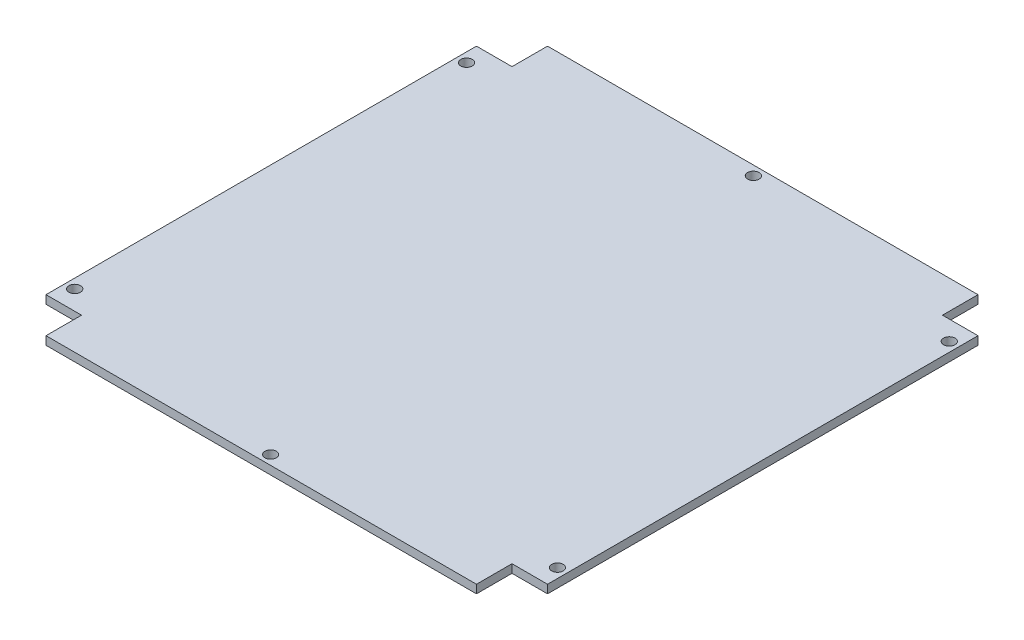
ISO-10303-21;
HEADER;
FILE_DESCRIPTION(('STEP AP214'),'2;1');
FILE_NAME('part.step','',(''),(''),'','','');
FILE_SCHEMA(('AUTOMOTIVE_DESIGN { 1 0 10303 214 1 1 1 1 }'));
ENDSEC;
DATA;
#1=APPLICATION_CONTEXT('core data for automotive mechanical design processes');
#2=APPLICATION_PROTOCOL_DEFINITION('international standard','automotive_design',2000,#1);
#3=PRODUCT_CONTEXT('',#1,'mechanical');
#4=PRODUCT('Part','Part','',(#3));
#5=PRODUCT_RELATED_PRODUCT_CATEGORY('part','',(#4));
#6=PRODUCT_DEFINITION_FORMATION('','',#4);
#7=PRODUCT_DEFINITION_CONTEXT('part definition',#1,'design');
#8=PRODUCT_DEFINITION('design','',#6,#7);
#9=PRODUCT_DEFINITION_SHAPE('','',#8);
#10=(LENGTH_UNIT() NAMED_UNIT(*) SI_UNIT(.MILLI.,.METRE.));
#11=(NAMED_UNIT(*) PLANE_ANGLE_UNIT() SI_UNIT($,.RADIAN.));
#12=(NAMED_UNIT(*) SI_UNIT($,.STERADIAN.) SOLID_ANGLE_UNIT());
#13=UNCERTAINTY_MEASURE_WITH_UNIT(LENGTH_MEASURE(1.E-05),#10,'distance_accuracy_value','');
#14=(GEOMETRIC_REPRESENTATION_CONTEXT(3) GLOBAL_UNCERTAINTY_ASSIGNED_CONTEXT((#13)) GLOBAL_UNIT_ASSIGNED_CONTEXT((#10,
#11,#12)) REPRESENTATION_CONTEXT('',''));
#15=CARTESIAN_POINT('',(0.,0.,0.));
#16=DIRECTION('',(0.,0.,1.));
#17=DIRECTION('',(1.,0.,0.));
#18=AXIS2_PLACEMENT_3D('',#15,#16,#17);
#19=CARTESIAN_POINT('',(-27.1443844543068,1.6,54.7714964370546));
#20=DIRECTION('',(0.,0.,1.));
#21=DIRECTION('',(1.,0.,0.));
#22=AXIS2_PLACEMENT_3D('',#19,#20,#21);
#23=PLANE('',#22);
#24=DIRECTION('',(0.,1.,0.));
#25=VECTOR('',#24,1.);
#26=CARTESIAN_POINT('',(-33.9443844543068,0.,54.7714964370546));
#27=LINE('',#26,#25);
#28=CARTESIAN_POINT('',(-33.9443844543068,0.,54.7714964370546));
#29=VERTEX_POINT('',#28);
#30=CARTESIAN_POINT('',(-33.9443844543068,1.6,54.7714964370546));
#31=VERTEX_POINT('',#30);
#32=EDGE_CURVE('E128',#29,#31,#27,.T.);
#33=ORIENTED_EDGE('',*,*,#32,.F.);
#34=DIRECTION('',(-1.,0.,0.));
#35=VECTOR('',#34,1.);
#36=CARTESIAN_POINT('',(-27.1443844543068,0.,54.7714964370546));
#37=LINE('',#36,#35);
#38=CARTESIAN_POINT('',(-27.1443844543068,0.,54.7714964370546));
#39=VERTEX_POINT('',#38);
#40=EDGE_CURVE('E139',#39,#29,#37,.T.);
#41=ORIENTED_EDGE('',*,*,#40,.F.);
#42=DIRECTION('',(0.,-1.,0.));
#43=VECTOR('',#42,1.);
#44=CARTESIAN_POINT('',(-27.1443844543068,1.6,54.7714964370546));
#45=LINE('',#44,#43);
#46=CARTESIAN_POINT('',(-27.1443844543068,1.6,54.7714964370546));
#47=VERTEX_POINT('',#46);
#48=EDGE_CURVE('E11',#47,#39,#45,.T.);
#49=ORIENTED_EDGE('',*,*,#48,.F.);
#50=DIRECTION('',(-1.,0.,0.));
#51=VECTOR('',#50,1.);
#52=CARTESIAN_POINT('',(-27.1443844543068,1.6,54.7714964370546));
#53=LINE('',#52,#51);
#54=EDGE_CURVE('E141',#47,#31,#53,.T.);
#55=ORIENTED_EDGE('',*,*,#54,.T.);
#56=EDGE_LOOP('',(#33,#41,#49,#55));
#57=FACE_BOUND('',#56,.T.);
#58=ADVANCED_FACE('F38',(#57),#23,.T.);
#59=CARTESIAN_POINT('',(-27.1443844543068,1.6,61.7714964370546));
#60=DIRECTION('',(-1.,0.,0.));
#61=DIRECTION('',(0.,0.,1.));
#62=AXIS2_PLACEMENT_3D('',#59,#60,#61);
#63=PLANE('',#62);
#64=DIRECTION('',(0.,1.,0.));
#65=VECTOR('',#64,1.);
#66=CARTESIAN_POINT('',(-27.1443844543068,0.,61.5714964370546));
#67=LINE('',#66,#65);
#68=CARTESIAN_POINT('',(-27.1443844543068,0.,61.5714964370546));
#69=VERTEX_POINT('',#68);
#70=CARTESIAN_POINT('',(-27.1443844543068,1.6,61.5714964370546));
#71=VERTEX_POINT('',#70);
#72=EDGE_CURVE('E62',#69,#71,#67,.T.);
#73=ORIENTED_EDGE('',*,*,#72,.T.);
#74=DIRECTION('',(0.,0.,-1.));
#75=VECTOR('',#74,1.);
#76=CARTESIAN_POINT('',(-27.1443844543068,1.6,61.7714964370546));
#77=LINE('',#76,#75);
#78=EDGE_CURVE('E156',#71,#47,#77,.T.);
#79=ORIENTED_EDGE('',*,*,#78,.T.);
#80=ORIENTED_EDGE('',*,*,#48,.T.);
#81=DIRECTION('',(0.,0.,-1.));
#82=VECTOR('',#81,1.);
#83=CARTESIAN_POINT('',(-27.1443844543068,0.,61.7714964370546));
#84=LINE('',#83,#82);
#85=EDGE_CURVE('E146',#69,#39,#84,.T.);
#86=ORIENTED_EDGE('',*,*,#85,.F.);
#87=EDGE_LOOP('',(#73,#79,#80,#86));
#88=FACE_BOUND('',#87,.T.);
#89=ADVANCED_FACE('F221',(#88),#63,.T.);
#90=CARTESIAN_POINT('',(55.2556155456932,1.6,54.7714964370546));
#91=DIRECTION('',(1.,0.,0.));
#92=DIRECTION('',(0.,0.,-1.));
#93=AXIS2_PLACEMENT_3D('',#90,#91,#92);
#94=PLANE('',#93);
#95=DIRECTION('',(0.,1.,0.));
#96=VECTOR('',#95,1.);
#97=CARTESIAN_POINT('',(55.2556155456932,0.,61.5714964370546));
#98=LINE('',#97,#96);
#99=CARTESIAN_POINT('',(55.2556155456932,0.,61.5714964370546));
#100=VERTEX_POINT('',#99);
#101=CARTESIAN_POINT('',(55.2556155456932,1.6,61.5714964370546));
#102=VERTEX_POINT('',#101);
#103=EDGE_CURVE('E233',#100,#102,#98,.T.);
#104=ORIENTED_EDGE('',*,*,#103,.F.);
#105=DIRECTION('',(0.,0.,1.));
#106=VECTOR('',#105,1.);
#107=CARTESIAN_POINT('',(55.2556155456932,0.,54.7714964370546));
#108=LINE('',#107,#106);
#109=CARTESIAN_POINT('',(55.2556155456932,0.,54.7714964370546));
#110=VERTEX_POINT('',#109);
#111=EDGE_CURVE('E168',#110,#100,#108,.T.);
#112=ORIENTED_EDGE('',*,*,#111,.F.);
#113=DIRECTION('',(0.,-1.,0.));
#114=VECTOR('',#113,1.);
#115=CARTESIAN_POINT('',(55.2556155456932,1.6,54.7714964370546));
#116=LINE('',#115,#114);
#117=CARTESIAN_POINT('',(55.2556155456932,1.6,54.7714964370546));
#118=VERTEX_POINT('',#117);
#119=EDGE_CURVE('E46',#118,#110,#116,.T.);
#120=ORIENTED_EDGE('',*,*,#119,.F.);
#121=DIRECTION('',(0.,0.,1.));
#122=VECTOR('',#121,1.);
#123=CARTESIAN_POINT('',(55.2556155456932,1.6,54.7714964370546));
#124=LINE('',#123,#122);
#125=EDGE_CURVE('E213',#118,#102,#124,.T.);
#126=ORIENTED_EDGE('',*,*,#125,.T.);
#127=EDGE_LOOP('',(#104,#112,#120,#126));
#128=FACE_BOUND('',#127,.T.);
#129=ADVANCED_FACE('F301',(#128),#94,.T.);
#130=CARTESIAN_POINT('',(62.2556155456932,1.6,54.7714964370546));
#131=DIRECTION('',(0.,0.,1.));
#132=DIRECTION('',(1.,0.,0.));
#133=AXIS2_PLACEMENT_3D('',#130,#131,#132);
#134=PLANE('',#133);
#135=DIRECTION('',(0.,1.,0.));
#136=VECTOR('',#135,1.);
#137=CARTESIAN_POINT('',(62.0556155456932,0.,54.7714964370546));
#138=LINE('',#137,#136);
#139=CARTESIAN_POINT('',(62.0556155456932,0.,54.7714964370546));
#140=VERTEX_POINT('',#139);
#141=CARTESIAN_POINT('',(62.0556155456932,1.6,54.7714964370546));
#142=VERTEX_POINT('',#141);
#143=EDGE_CURVE('E243',#140,#142,#138,.T.);
#144=ORIENTED_EDGE('',*,*,#143,.T.);
#145=DIRECTION('',(-1.,0.,0.));
#146=VECTOR('',#145,1.);
#147=CARTESIAN_POINT('',(62.2556155456932,1.6,54.7714964370546));
#148=LINE('',#147,#146);
#149=EDGE_CURVE('E212',#142,#118,#148,.T.);
#150=ORIENTED_EDGE('',*,*,#149,.T.);
#151=ORIENTED_EDGE('',*,*,#119,.T.);
#152=DIRECTION('',(-1.,0.,0.));
#153=VECTOR('',#152,1.);
#154=CARTESIAN_POINT('',(62.2556155456932,0.,54.7714964370546));
#155=LINE('',#154,#153);
#156=EDGE_CURVE('E166',#140,#110,#155,.T.);
#157=ORIENTED_EDGE('',*,*,#156,.F.);
#158=EDGE_LOOP('',(#144,#150,#151,#157));
#159=FACE_BOUND('',#158,.T.);
#160=ADVANCED_FACE('F306',(#159),#134,.T.);
#161=CARTESIAN_POINT('',(55.2556155456932,1.6,-27.6285035629454));
#162=DIRECTION('',(0.,0.,-1.));
#163=DIRECTION('',(-1.,0.,0.));
#164=AXIS2_PLACEMENT_3D('',#161,#162,#163);
#165=PLANE('',#164);
#166=DIRECTION('',(0.,1.,0.));
#167=VECTOR('',#166,1.);
#168=CARTESIAN_POINT('',(62.0556155456932,0.,-27.6285035629454));
#169=LINE('',#168,#167);
#170=CARTESIAN_POINT('',(62.0556155456932,0.,-27.6285035629454));
#171=VERTEX_POINT('',#170);
#172=CARTESIAN_POINT('',(62.0556155456932,1.6,-27.6285035629454));
#173=VERTEX_POINT('',#172);
#174=EDGE_CURVE('E241',#171,#173,#169,.T.);
#175=ORIENTED_EDGE('',*,*,#174,.F.);
#176=DIRECTION('',(1.,0.,0.));
#177=VECTOR('',#176,1.);
#178=CARTESIAN_POINT('',(55.2556155456932,0.,-27.6285035629454));
#179=LINE('',#178,#177);
#180=CARTESIAN_POINT('',(55.2556155456932,0.,-27.6285035629454));
#181=VERTEX_POINT('',#180);
#182=EDGE_CURVE('E163',#181,#171,#179,.T.);
#183=ORIENTED_EDGE('',*,*,#182,.F.);
#184=DIRECTION('',(0.,-1.,0.));
#185=VECTOR('',#184,1.);
#186=CARTESIAN_POINT('',(55.2556155456932,1.6,-27.6285035629454));
#187=LINE('',#186,#185);
#188=CARTESIAN_POINT('',(55.2556155456932,1.6,-27.6285035629454));
#189=VERTEX_POINT('',#188);
#190=EDGE_CURVE('E174',#189,#181,#187,.T.);
#191=ORIENTED_EDGE('',*,*,#190,.F.);
#192=DIRECTION('',(1.,0.,0.));
#193=VECTOR('',#192,1.);
#194=CARTESIAN_POINT('',(55.2556155456932,1.6,-27.6285035629454));
#195=LINE('',#194,#193);
#196=EDGE_CURVE('E209',#189,#173,#195,.T.);
#197=ORIENTED_EDGE('',*,*,#196,.T.);
#198=EDGE_LOOP('',(#175,#183,#191,#197));
#199=FACE_BOUND('',#198,.T.);
#200=ADVANCED_FACE('F311',(#199),#165,.T.);
#201=CARTESIAN_POINT('',(55.2556155456932,1.6,-34.6285035629454));
#202=DIRECTION('',(1.,0.,0.));
#203=DIRECTION('',(0.,0.,-1.));
#204=AXIS2_PLACEMENT_3D('',#201,#202,#203);
#205=PLANE('',#204);
#206=DIRECTION('',(0.,1.,0.));
#207=VECTOR('',#206,1.);
#208=CARTESIAN_POINT('',(55.2556155456932,0.,-34.4285035629454));
#209=LINE('',#208,#207);
#210=CARTESIAN_POINT('',(55.2556155456932,0.,-34.4285035629454));
#211=VERTEX_POINT('',#210);
#212=CARTESIAN_POINT('',(55.2556155456932,1.6,-34.4285035629454));
#213=VERTEX_POINT('',#212);
#214=EDGE_CURVE('E253',#211,#213,#209,.T.);
#215=ORIENTED_EDGE('',*,*,#214,.T.);
#216=DIRECTION('',(0.,0.,1.));
#217=VECTOR('',#216,1.);
#218=CARTESIAN_POINT('',(55.2556155456932,1.6,-34.6285035629454));
#219=LINE('',#218,#217);
#220=EDGE_CURVE('E207',#213,#189,#219,.T.);
#221=ORIENTED_EDGE('',*,*,#220,.T.);
#222=ORIENTED_EDGE('',*,*,#190,.T.);
#223=DIRECTION('',(0.,0.,1.));
#224=VECTOR('',#223,1.);
#225=CARTESIAN_POINT('',(55.2556155456932,0.,-34.6285035629454));
#226=LINE('',#225,#224);
#227=EDGE_CURVE('E161',#211,#181,#226,.T.);
#228=ORIENTED_EDGE('',*,*,#227,.F.);
#229=EDGE_LOOP('',(#215,#221,#222,#228));
#230=FACE_BOUND('',#229,.T.);
#231=ADVANCED_FACE('F315',(#230),#205,.T.);
#232=CARTESIAN_POINT('',(-27.1443844543068,1.6,-27.6285035629454));
#233=DIRECTION('',(-1.,0.,0.));
#234=DIRECTION('',(0.,0.,1.));
#235=AXIS2_PLACEMENT_3D('',#232,#233,#234);
#236=PLANE('',#235);
#237=DIRECTION('',(0.,1.,0.));
#238=VECTOR('',#237,1.);
#239=CARTESIAN_POINT('',(-27.1443844543068,0.,-34.4285035629454));
#240=LINE('',#239,#238);
#241=CARTESIAN_POINT('',(-27.1443844543068,0.,-34.4285035629454));
#242=VERTEX_POINT('',#241);
#243=CARTESIAN_POINT('',(-27.1443844543068,1.6,-34.4285035629454));
#244=VERTEX_POINT('',#243);
#245=EDGE_CURVE('E251',#242,#244,#240,.T.);
#246=ORIENTED_EDGE('',*,*,#245,.F.);
#247=DIRECTION('',(0.,0.,-1.));
#248=VECTOR('',#247,1.);
#249=CARTESIAN_POINT('',(-27.1443844543068,0.,-27.6285035629454));
#250=LINE('',#249,#248);
#251=CARTESIAN_POINT('',(-27.1443844543068,0.,-27.6285035629454));
#252=VERTEX_POINT('',#251);
#253=EDGE_CURVE('E150',#252,#242,#250,.T.);
#254=ORIENTED_EDGE('',*,*,#253,.F.);
#255=DIRECTION('',(0.,-1.,0.));
#256=VECTOR('',#255,1.);
#257=CARTESIAN_POINT('',(-27.1443844543068,1.6,-27.6285035629454));
#258=LINE('',#257,#256);
#259=CARTESIAN_POINT('',(-27.1443844543068,1.6,-27.6285035629454));
#260=VERTEX_POINT('',#259);
#261=EDGE_CURVE('E177',#260,#252,#258,.T.);
#262=ORIENTED_EDGE('',*,*,#261,.F.);
#263=DIRECTION('',(0.,0.,-1.));
#264=VECTOR('',#263,1.);
#265=CARTESIAN_POINT('',(-27.1443844543068,1.6,-27.6285035629454));
#266=LINE('',#265,#264);
#267=EDGE_CURVE('E204',#260,#244,#266,.T.);
#268=ORIENTED_EDGE('',*,*,#267,.T.);
#269=EDGE_LOOP('',(#246,#254,#262,#268));
#270=FACE_BOUND('',#269,.T.);
#271=ADVANCED_FACE('F319',(#270),#236,.T.);
#272=CARTESIAN_POINT('',(-34.1443844543068,1.6,-27.6285035629454));
#273=DIRECTION('',(0.,0.,-1.));
#274=DIRECTION('',(-1.,0.,0.));
#275=AXIS2_PLACEMENT_3D('',#272,#273,#274);
#276=PLANE('',#275);
#277=DIRECTION('',(0.,1.,0.));
#278=VECTOR('',#277,1.);
#279=CARTESIAN_POINT('',(-33.9443844543068,0.,-27.6285035629454));
#280=LINE('',#279,#278);
#281=CARTESIAN_POINT('',(-33.9443844543068,0.,-27.6285035629454));
#282=VERTEX_POINT('',#281);
#283=CARTESIAN_POINT('',(-33.9443844543068,1.6,-27.6285035629454));
#284=VERTEX_POINT('',#283);
#285=EDGE_CURVE('E54',#282,#284,#280,.T.);
#286=ORIENTED_EDGE('',*,*,#285,.T.);
#287=DIRECTION('',(1.,0.,0.));
#288=VECTOR('',#287,1.);
#289=CARTESIAN_POINT('',(-34.1443844543068,1.6,-27.6285035629454));
#290=LINE('',#289,#288);
#291=EDGE_CURVE('E202',#284,#260,#290,.T.);
#292=ORIENTED_EDGE('',*,*,#291,.T.);
#293=ORIENTED_EDGE('',*,*,#261,.T.);
#294=DIRECTION('',(1.,0.,0.));
#295=VECTOR('',#294,1.);
#296=CARTESIAN_POINT('',(-34.1443844543068,0.,-27.6285035629454));
#297=LINE('',#296,#295);
#298=EDGE_CURVE('E147',#282,#252,#297,.T.);
#299=ORIENTED_EDGE('',*,*,#298,.F.);
#300=EDGE_LOOP('',(#286,#292,#293,#299));
#301=FACE_BOUND('',#300,.T.);
#302=ADVANCED_FACE('F276',(#301),#276,.T.);
#303=CARTESIAN_POINT('',(0.,1.6,0.));
#304=DIRECTION('',(0.,-1.,0.));
#305=DIRECTION('',(0.,0.,-1.));
#306=AXIS2_PLACEMENT_3D('',#303,#304,#305);
#307=PLANE('',#306);
#308=CARTESIAN_POINT('',(14.0556155456932,1.6,-32.6285035629454));
#309=DIRECTION('',(0.,1.,0.));
#310=DIRECTION('',(0.,0.,1.));
#311=AXIS2_PLACEMENT_3D('',#308,#309,#310);
#312=CIRCLE('',#311,1.09999999999999);
#313=CARTESIAN_POINT('',(14.0556155456932,1.6,-31.5285035629454));
#314=VERTEX_POINT('',#313);
#315=EDGE_CURVE('E256',#314,#314,#312,.T.);
#316=ORIENTED_EDGE('',*,*,#315,.F.);
#317=EDGE_LOOP('',(#316));
#318=FACE_BOUND('',#317,.T.);
#319=CARTESIAN_POINT('',(14.0556155456932,1.6,59.7714964370546));
#320=DIRECTION('',(0.,1.,0.));
#321=DIRECTION('',(0.,0.,1.));
#322=AXIS2_PLACEMENT_3D('',#319,#320,#321);
#323=CIRCLE('',#322,1.09999999999999);
#324=CARTESIAN_POINT('',(14.0556155456932,1.6,60.8714964370546));
#325=VERTEX_POINT('',#324);
#326=EDGE_CURVE('E263',#325,#325,#323,.T.);
#327=ORIENTED_EDGE('',*,*,#326,.F.);
#328=EDGE_LOOP('',(#327));
#329=FACE_BOUND('',#328,.T.);
#330=CARTESIAN_POINT('',(-32.1443844543068,1.6,51.0714964370546));
#331=DIRECTION('',(0.,1.,0.));
#332=DIRECTION('',(0.,0.,1.));
#333=AXIS2_PLACEMENT_3D('',#330,#331,#332);
#334=CIRCLE('',#333,1.09999999999999);
#335=CARTESIAN_POINT('',(-32.1443844543068,1.6,52.1714964370546));
#336=VERTEX_POINT('',#335);
#337=EDGE_CURVE('E193',#336,#336,#334,.T.);
#338=ORIENTED_EDGE('',*,*,#337,.F.);
#339=EDGE_LOOP('',(#338));
#340=FACE_BOUND('',#339,.T.);
#341=CARTESIAN_POINT('',(60.2556155456932,1.6,-23.9285035629454));
#342=DIRECTION('',(0.,1.,0.));
#343=DIRECTION('',(0.,0.,1.));
#344=AXIS2_PLACEMENT_3D('',#341,#342,#343);
#345=CIRCLE('',#344,1.09999999999999);
#346=CARTESIAN_POINT('',(60.2556155456932,1.6,-22.8285035629454));
#347=VERTEX_POINT('',#346);
#348=EDGE_CURVE('E182',#347,#347,#345,.T.);
#349=ORIENTED_EDGE('',*,*,#348,.F.);
#350=EDGE_LOOP('',(#349));
#351=FACE_BOUND('',#350,.T.);
#352=CARTESIAN_POINT('',(-32.1443844543068,1.6,-23.9285035629454));
#353=DIRECTION('',(0.,1.,0.));
#354=DIRECTION('',(0.,0.,1.));
#355=AXIS2_PLACEMENT_3D('',#352,#353,#354);
#356=CIRCLE('',#355,1.09999999999999);
#357=CARTESIAN_POINT('',(-32.1443844543068,1.6,-22.8285035629454));
#358=VERTEX_POINT('',#357);
#359=EDGE_CURVE('E181',#358,#358,#356,.T.);
#360=ORIENTED_EDGE('',*,*,#359,.F.);
#361=EDGE_LOOP('',(#360));
#362=FACE_BOUND('',#361,.T.);
#363=CARTESIAN_POINT('',(60.2556155456932,1.6,51.0714964370546));
#364=DIRECTION('',(0.,1.,0.));
#365=DIRECTION('',(0.,0.,1.));
#366=AXIS2_PLACEMENT_3D('',#363,#364,#365);
#367=CIRCLE('',#366,1.09999999999999);
#368=CARTESIAN_POINT('',(60.2556155456932,1.6,52.1714964370546));
#369=VERTEX_POINT('',#368);
#370=EDGE_CURVE('E153',#369,#369,#367,.T.);
#371=ORIENTED_EDGE('',*,*,#370,.F.);
#372=EDGE_LOOP('',(#371));
#373=FACE_BOUND('',#372,.T.);
#374=ORIENTED_EDGE('',*,*,#291,.F.);
#375=DIRECTION('',(0.,0.,-1.));
#376=VECTOR('',#375,1.);
#377=CARTESIAN_POINT('',(-33.9443844543068,1.6,54.7714964370546));
#378=LINE('',#377,#376);
#379=EDGE_CURVE('E133',#31,#284,#378,.T.);
#380=ORIENTED_EDGE('',*,*,#379,.F.);
#381=ORIENTED_EDGE('',*,*,#54,.F.);
#382=ORIENTED_EDGE('',*,*,#78,.F.);
#383=DIRECTION('',(-1.,0.,0.));
#384=VECTOR('',#383,1.);
#385=CARTESIAN_POINT('',(55.2556155456932,1.6,61.5714964370546));
#386=LINE('',#385,#384);
#387=EDGE_CURVE('E229',#102,#71,#386,.T.);
#388=ORIENTED_EDGE('',*,*,#387,.F.);
#389=ORIENTED_EDGE('',*,*,#125,.F.);
#390=ORIENTED_EDGE('',*,*,#149,.F.);
#391=DIRECTION('',(0.,0.,1.));
#392=VECTOR('',#391,1.);
#393=CARTESIAN_POINT('',(62.0556155456932,1.6,-27.6285035629454));
#394=LINE('',#393,#392);
#395=EDGE_CURVE('E236',#173,#142,#394,.T.);
#396=ORIENTED_EDGE('',*,*,#395,.F.);
#397=ORIENTED_EDGE('',*,*,#196,.F.);
#398=ORIENTED_EDGE('',*,*,#220,.F.);
#399=DIRECTION('',(1.,0.,0.));
#400=VECTOR('',#399,1.);
#401=CARTESIAN_POINT('',(-27.1443844543068,1.6,-34.4285035629454));
#402=LINE('',#401,#400);
#403=EDGE_CURVE('E246',#244,#213,#402,.T.);
#404=ORIENTED_EDGE('',*,*,#403,.F.);
#405=ORIENTED_EDGE('',*,*,#267,.F.);
#406=EDGE_LOOP('',(#374,#380,#381,#382,#388,#389,#390,#396,#397,#398,#404,#405));
#407=FACE_BOUND('',#406,.T.);
#408=ADVANCED_FACE('F225',(#318,#329,#340,#351,#362,#373,#407),#307,.F.);
#409=CARTESIAN_POINT('',(0.,0.,0.));
#410=DIRECTION('',(0.,-1.,0.));
#411=DIRECTION('',(0.,0.,-1.));
#412=AXIS2_PLACEMENT_3D('',#409,#410,#411);
#413=PLANE('',#412);
#414=DIRECTION('',(0.,0.,-1.));
#415=VECTOR('',#414,1.);
#416=CARTESIAN_POINT('',(-33.9443844543068,0.,54.7714964370546));
#417=LINE('',#416,#415);
#418=EDGE_CURVE('E125',#29,#282,#417,.T.);
#419=ORIENTED_EDGE('',*,*,#418,.T.);
#420=ORIENTED_EDGE('',*,*,#298,.T.);
#421=ORIENTED_EDGE('',*,*,#253,.T.);
#422=DIRECTION('',(1.,0.,0.));
#423=VECTOR('',#422,1.);
#424=CARTESIAN_POINT('',(-27.1443844543068,0.,-34.4285035629454));
#425=LINE('',#424,#423);
#426=EDGE_CURVE('E248',#242,#211,#425,.T.);
#427=ORIENTED_EDGE('',*,*,#426,.T.);
#428=ORIENTED_EDGE('',*,*,#227,.T.);
#429=ORIENTED_EDGE('',*,*,#182,.T.);
#430=DIRECTION('',(0.,0.,1.));
#431=VECTOR('',#430,1.);
#432=CARTESIAN_POINT('',(62.0556155456932,0.,-27.6285035629454));
#433=LINE('',#432,#431);
#434=EDGE_CURVE('E238',#171,#140,#433,.T.);
#435=ORIENTED_EDGE('',*,*,#434,.T.);
#436=ORIENTED_EDGE('',*,*,#156,.T.);
#437=ORIENTED_EDGE('',*,*,#111,.T.);
#438=DIRECTION('',(-1.,0.,0.));
#439=VECTOR('',#438,1.);
#440=CARTESIAN_POINT('',(55.2556155456932,0.,61.5714964370546));
#441=LINE('',#440,#439);
#442=EDGE_CURVE('E231',#100,#69,#441,.T.);
#443=ORIENTED_EDGE('',*,*,#442,.T.);
#444=ORIENTED_EDGE('',*,*,#85,.T.);
#445=ORIENTED_EDGE('',*,*,#40,.T.);
#446=EDGE_LOOP('',(#419,#420,#421,#427,#428,#429,#435,#436,#437,#443,#444,#445));
#447=FACE_BOUND('',#446,.T.);
#448=CARTESIAN_POINT('',(14.0556155456932,0.,-32.6285035629454));
#449=DIRECTION('',(0.,-1.,0.));
#450=DIRECTION('',(0.,0.,-1.));
#451=AXIS2_PLACEMENT_3D('',#448,#449,#450);
#452=CIRCLE('',#451,1.09999999999999);
#453=CARTESIAN_POINT('',(14.0556155456932,0.,-33.7285035629454));
#454=VERTEX_POINT('',#453);
#455=EDGE_CURVE('E260',#454,#454,#452,.T.);
#456=ORIENTED_EDGE('',*,*,#455,.F.);
#457=EDGE_LOOP('',(#456));
#458=FACE_BOUND('',#457,.T.);
#459=CARTESIAN_POINT('',(14.0556155456932,0.,59.7714964370546));
#460=DIRECTION('',(0.,-1.,0.));
#461=DIRECTION('',(0.,0.,-1.));
#462=AXIS2_PLACEMENT_3D('',#459,#460,#461);
#463=CIRCLE('',#462,1.09999999999999);
#464=CARTESIAN_POINT('',(14.0556155456932,0.,58.6714964370546));
#465=VERTEX_POINT('',#464);
#466=EDGE_CURVE('E265',#465,#465,#463,.T.);
#467=ORIENTED_EDGE('',*,*,#466,.F.);
#468=EDGE_LOOP('',(#467));
#469=FACE_BOUND('',#468,.T.);
#470=CARTESIAN_POINT('',(-32.1443844543068,0.,51.0714964370546));
#471=DIRECTION('',(0.,-1.,0.));
#472=DIRECTION('',(0.,0.,-1.));
#473=AXIS2_PLACEMENT_3D('',#470,#471,#472);
#474=CIRCLE('',#473,1.09999999999999);
#475=CARTESIAN_POINT('',(-32.1443844543068,0.,49.9714964370546));
#476=VERTEX_POINT('',#475);
#477=EDGE_CURVE('E41',#476,#476,#474,.T.);
#478=ORIENTED_EDGE('',*,*,#477,.F.);
#479=EDGE_LOOP('',(#478));
#480=FACE_BOUND('',#479,.T.);
#481=CARTESIAN_POINT('',(60.2556155456932,0.,-23.9285035629454));
#482=DIRECTION('',(0.,-1.,0.));
#483=DIRECTION('',(0.,0.,-1.));
#484=AXIS2_PLACEMENT_3D('',#481,#482,#483);
#485=CIRCLE('',#484,1.09999999999999);
#486=CARTESIAN_POINT('',(60.2556155456932,0.,-25.0285035629454));
#487=VERTEX_POINT('',#486);
#488=EDGE_CURVE('E179',#487,#487,#485,.T.);
#489=ORIENTED_EDGE('',*,*,#488,.F.);
#490=EDGE_LOOP('',(#489));
#491=FACE_BOUND('',#490,.T.);
#492=CARTESIAN_POINT('',(-32.1443844543068,0.,-23.9285035629454));
#493=DIRECTION('',(0.,-1.,0.));
#494=DIRECTION('',(0.,0.,-1.));
#495=AXIS2_PLACEMENT_3D('',#492,#493,#494);
#496=CIRCLE('',#495,1.09999999999999);
#497=CARTESIAN_POINT('',(-32.1443844543068,0.,-25.0285035629454));
#498=VERTEX_POINT('',#497);
#499=EDGE_CURVE('E186',#498,#498,#496,.T.);
#500=ORIENTED_EDGE('',*,*,#499,.F.);
#501=EDGE_LOOP('',(#500));
#502=FACE_BOUND('',#501,.T.);
#503=CARTESIAN_POINT('',(60.2556155456932,0.,51.0714964370546));
#504=DIRECTION('',(0.,-1.,0.));
#505=DIRECTION('',(0.,0.,-1.));
#506=AXIS2_PLACEMENT_3D('',#503,#504,#505);
#507=CIRCLE('',#506,1.09999999999999);
#508=CARTESIAN_POINT('',(60.2556155456932,0.,49.9714964370546));
#509=VERTEX_POINT('',#508);
#510=EDGE_CURVE('E148',#509,#509,#507,.T.);
#511=ORIENTED_EDGE('',*,*,#510,.F.);
#512=EDGE_LOOP('',(#511));
#513=FACE_BOUND('',#512,.T.);
#514=ADVANCED_FACE('F143',(#447,#458,#469,#480,#491,#502,#513),#413,.T.);
#515=CARTESIAN_POINT('',(60.2556155456932,1.6,51.0714964370546));
#516=DIRECTION('',(0.,1.,0.));
#517=DIRECTION('',(0.,0.,1.));
#518=AXIS2_PLACEMENT_3D('',#515,#516,#517);
#519=CYLINDRICAL_SURFACE('',#518,1.09999999999999);
#520=ORIENTED_EDGE('',*,*,#510,.T.);
#521=EDGE_LOOP('',(#520));
#522=FACE_BOUND('',#521,.T.);
#523=ORIENTED_EDGE('',*,*,#370,.T.);
#524=EDGE_LOOP('',(#523));
#525=FACE_BOUND('',#524,.T.);
#526=ADVANCED_FACE('F284',(#522,#525),#519,.F.);
#527=CARTESIAN_POINT('',(-32.1443844543068,1.6,-23.9285035629454));
#528=DIRECTION('',(0.,1.,0.));
#529=DIRECTION('',(0.,0.,1.));
#530=AXIS2_PLACEMENT_3D('',#527,#528,#529);
#531=CYLINDRICAL_SURFACE('',#530,1.09999999999999);
#532=ORIENTED_EDGE('',*,*,#499,.T.);
#533=EDGE_LOOP('',(#532));
#534=FACE_BOUND('',#533,.T.);
#535=ORIENTED_EDGE('',*,*,#359,.T.);
#536=EDGE_LOOP('',(#535));
#537=FACE_BOUND('',#536,.T.);
#538=ADVANCED_FACE('F286',(#534,#537),#531,.F.);
#539=CARTESIAN_POINT('',(60.2556155456932,1.6,-23.9285035629454));
#540=DIRECTION('',(0.,1.,0.));
#541=DIRECTION('',(0.,0.,1.));
#542=AXIS2_PLACEMENT_3D('',#539,#540,#541);
#543=CYLINDRICAL_SURFACE('',#542,1.09999999999999);
#544=ORIENTED_EDGE('',*,*,#488,.T.);
#545=EDGE_LOOP('',(#544));
#546=FACE_BOUND('',#545,.T.);
#547=ORIENTED_EDGE('',*,*,#348,.T.);
#548=EDGE_LOOP('',(#547));
#549=FACE_BOUND('',#548,.T.);
#550=ADVANCED_FACE('F293',(#546,#549),#543,.F.);
#551=CARTESIAN_POINT('',(-32.1443844543068,1.6,51.0714964370546));
#552=DIRECTION('',(0.,1.,0.));
#553=DIRECTION('',(0.,0.,1.));
#554=AXIS2_PLACEMENT_3D('',#551,#552,#553);
#555=CYLINDRICAL_SURFACE('',#554,1.09999999999999);
#556=ORIENTED_EDGE('',*,*,#477,.T.);
#557=EDGE_LOOP('',(#556));
#558=FACE_BOUND('',#557,.T.);
#559=ORIENTED_EDGE('',*,*,#337,.T.);
#560=EDGE_LOOP('',(#559));
#561=FACE_BOUND('',#560,.T.);
#562=ADVANCED_FACE('F272',(#558,#561),#555,.F.);
#563=CARTESIAN_POINT('',(14.0556155456932,1.6,59.7714964370546));
#564=DIRECTION('',(0.,1.,0.));
#565=DIRECTION('',(0.,0.,1.));
#566=AXIS2_PLACEMENT_3D('',#563,#564,#565);
#567=CYLINDRICAL_SURFACE('',#566,1.09999999999999);
#568=ORIENTED_EDGE('',*,*,#466,.T.);
#569=EDGE_LOOP('',(#568));
#570=FACE_BOUND('',#569,.T.);
#571=ORIENTED_EDGE('',*,*,#326,.T.);
#572=EDGE_LOOP('',(#571));
#573=FACE_BOUND('',#572,.T.);
#574=ADVANCED_FACE('F359',(#570,#573),#567,.F.);
#575=CARTESIAN_POINT('',(14.0556155456932,1.6,-32.6285035629454));
#576=DIRECTION('',(0.,1.,0.));
#577=DIRECTION('',(0.,0.,1.));
#578=AXIS2_PLACEMENT_3D('',#575,#576,#577);
#579=CYLINDRICAL_SURFACE('',#578,1.09999999999999);
#580=ORIENTED_EDGE('',*,*,#455,.T.);
#581=EDGE_LOOP('',(#580));
#582=FACE_BOUND('',#581,.T.);
#583=ORIENTED_EDGE('',*,*,#315,.T.);
#584=EDGE_LOOP('',(#583));
#585=FACE_BOUND('',#584,.T.);
#586=ADVANCED_FACE('F353',(#582,#585),#579,.F.);
#587=CARTESIAN_POINT('',(-27.1443844543068,0.,-34.4285035629454));
#588=DIRECTION('',(0.,0.,1.));
#589=DIRECTION('',(1.,0.,0.));
#590=AXIS2_PLACEMENT_3D('',#587,#588,#589);
#591=PLANE('',#590);
#592=ORIENTED_EDGE('',*,*,#403,.T.);
#593=ORIENTED_EDGE('',*,*,#214,.F.);
#594=ORIENTED_EDGE('',*,*,#426,.F.);
#595=ORIENTED_EDGE('',*,*,#245,.T.);
#596=EDGE_LOOP('',(#592,#593,#594,#595));
#597=FACE_BOUND('',#596,.T.);
#598=ADVANCED_FACE('F333',(#597),#591,.F.);
#599=CARTESIAN_POINT('',(62.0556155456932,0.,-27.6285035629454));
#600=DIRECTION('',(-1.,0.,0.));
#601=DIRECTION('',(0.,0.,1.));
#602=AXIS2_PLACEMENT_3D('',#599,#600,#601);
#603=PLANE('',#602);
#604=ORIENTED_EDGE('',*,*,#395,.T.);
#605=ORIENTED_EDGE('',*,*,#143,.F.);
#606=ORIENTED_EDGE('',*,*,#434,.F.);
#607=ORIENTED_EDGE('',*,*,#174,.T.);
#608=EDGE_LOOP('',(#604,#605,#606,#607));
#609=FACE_BOUND('',#608,.T.);
#610=ADVANCED_FACE('F345',(#609),#603,.F.);
#611=CARTESIAN_POINT('',(55.2556155456932,0.,61.5714964370546));
#612=DIRECTION('',(0.,0.,-1.));
#613=DIRECTION('',(-1.,0.,0.));
#614=AXIS2_PLACEMENT_3D('',#611,#612,#613);
#615=PLANE('',#614);
#616=ORIENTED_EDGE('',*,*,#387,.T.);
#617=ORIENTED_EDGE('',*,*,#72,.F.);
#618=ORIENTED_EDGE('',*,*,#442,.F.);
#619=ORIENTED_EDGE('',*,*,#103,.T.);
#620=EDGE_LOOP('',(#616,#617,#618,#619));
#621=FACE_BOUND('',#620,.T.);
#622=ADVANCED_FACE('F344',(#621),#615,.F.);
#623=CARTESIAN_POINT('',(-33.9443844543068,0.,54.7714964370546));
#624=DIRECTION('',(1.,0.,0.));
#625=DIRECTION('',(0.,0.,-1.));
#626=AXIS2_PLACEMENT_3D('',#623,#624,#625);
#627=PLANE('',#626);
#628=ORIENTED_EDGE('',*,*,#379,.T.);
#629=ORIENTED_EDGE('',*,*,#285,.F.);
#630=ORIENTED_EDGE('',*,*,#418,.F.);
#631=ORIENTED_EDGE('',*,*,#32,.T.);
#632=EDGE_LOOP('',(#628,#629,#630,#631));
#633=FACE_BOUND('',#632,.T.);
#634=ADVANCED_FACE('F127',(#633),#627,.F.);
#635=CLOSED_SHELL('',(#58,#89,#129,#160,#200,#231,#271,#302,#408,#514,#526,#538,#550,#562,#574,
#586,#598,#610,#622,#634));
#636=MANIFOLD_SOLID_BREP('B2',#635);
#637=ADVANCED_BREP_SHAPE_REPRESENTATION('',(#18,#636),#14);
#638=SHAPE_DEFINITION_REPRESENTATION(#9,#637);
ENDSEC;
END-ISO-10303-21;
